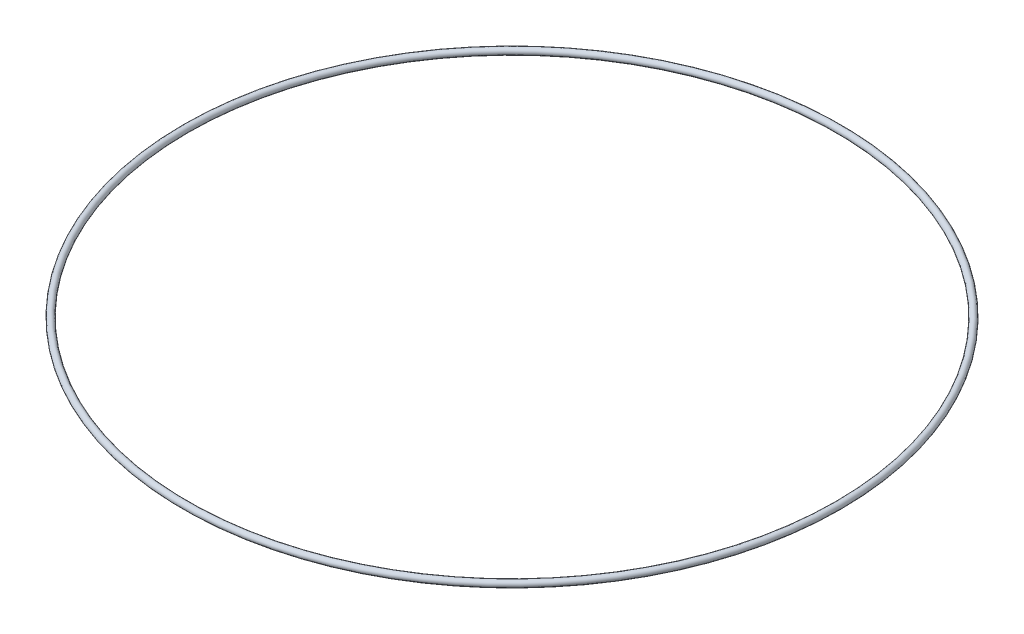
ISO-10303-21;
HEADER;
FILE_DESCRIPTION(('STEP AP214'),'2;1');
FILE_NAME('part.step','',(''),(''),'','','');
FILE_SCHEMA(('AUTOMOTIVE_DESIGN { 1 0 10303 214 1 1 1 1 }'));
ENDSEC;
DATA;
#1=APPLICATION_CONTEXT('core data for automotive mechanical design processes');
#2=APPLICATION_PROTOCOL_DEFINITION('international standard','automotive_design',2000,#1);
#3=PRODUCT_CONTEXT('',#1,'mechanical');
#4=PRODUCT('Part','Part','',(#3));
#5=PRODUCT_RELATED_PRODUCT_CATEGORY('part','',(#4));
#6=PRODUCT_DEFINITION_FORMATION('','',#4);
#7=PRODUCT_DEFINITION_CONTEXT('part definition',#1,'design');
#8=PRODUCT_DEFINITION('design','',#6,#7);
#9=PRODUCT_DEFINITION_SHAPE('','',#8);
#10=(LENGTH_UNIT() NAMED_UNIT(*) SI_UNIT(.MILLI.,.METRE.));
#11=(NAMED_UNIT(*) PLANE_ANGLE_UNIT() SI_UNIT($,.RADIAN.));
#12=(NAMED_UNIT(*) SI_UNIT($,.STERADIAN.) SOLID_ANGLE_UNIT());
#13=UNCERTAINTY_MEASURE_WITH_UNIT(LENGTH_MEASURE(1.E-05),#10,'distance_accuracy_value','');
#14=(GEOMETRIC_REPRESENTATION_CONTEXT(3) GLOBAL_UNCERTAINTY_ASSIGNED_CONTEXT((#13)) GLOBAL_UNIT_ASSIGNED_CONTEXT((#10,
#11,#12)) REPRESENTATION_CONTEXT('',''));
#15=CARTESIAN_POINT('',(0.,0.,0.));
#16=DIRECTION('',(0.,0.,1.));
#17=DIRECTION('',(1.,0.,0.));
#18=AXIS2_PLACEMENT_3D('',#15,#16,#17);
#19=CARTESIAN_POINT('',(0.,0.,0.));
#20=DIRECTION('',(0.,-1.,0.));
#21=DIRECTION('',(0.,0.,-1.));
#22=AXIS2_PLACEMENT_3D('',#19,#20,#21);
#23=TOROIDAL_SURFACE('',#22,5.,0.0499999999999997);
#24=CARTESIAN_POINT('',(-5.,0.,0.));
#25=DIRECTION('',(0.,0.,1.));
#26=DIRECTION('',(1.,0.,0.));
#27=AXIS2_PLACEMENT_3D('',#24,#25,#26);
#28=CIRCLE('',#27,0.0499999999999997);
#29=CARTESIAN_POINT('',(-5.05,0.,0.));
#30=VERTEX_POINT('',#29);
#31=EDGE_CURVE('E10',#30,#30,#28,.T.);
#32=CARTESIAN_POINT('',(0.,0.,0.));
#33=DIRECTION('',(0.,-1.,0.));
#34=DIRECTION('',(0.,0.,-1.));
#35=AXIS2_PLACEMENT_3D('',#32,#33,#34);
#36=CIRCLE('',#35,5.05);
#37=EDGE_CURVE('',#30,#30,#36,.T.);
#38=ORIENTED_EDGE('',*,*,#31,.F.);
#39=ORIENTED_EDGE('',*,*,#31,.T.);
#40=ORIENTED_EDGE('',*,*,#37,.T.);
#41=ORIENTED_EDGE('',*,*,#37,.F.);
#42=EDGE_LOOP('',(#38,#40,#39,#41));
#43=FACE_BOUND('',#42,.T.);
#44=ADVANCED_FACE('F32',(#43),#23,.T.);
#45=CLOSED_SHELL('',(#44));
#46=MANIFOLD_SOLID_BREP('B2',#45);
#47=ADVANCED_BREP_SHAPE_REPRESENTATION('',(#18,#46),#14);
#48=SHAPE_DEFINITION_REPRESENTATION(#9,#47);
ENDSEC;
END-ISO-10303-21;
